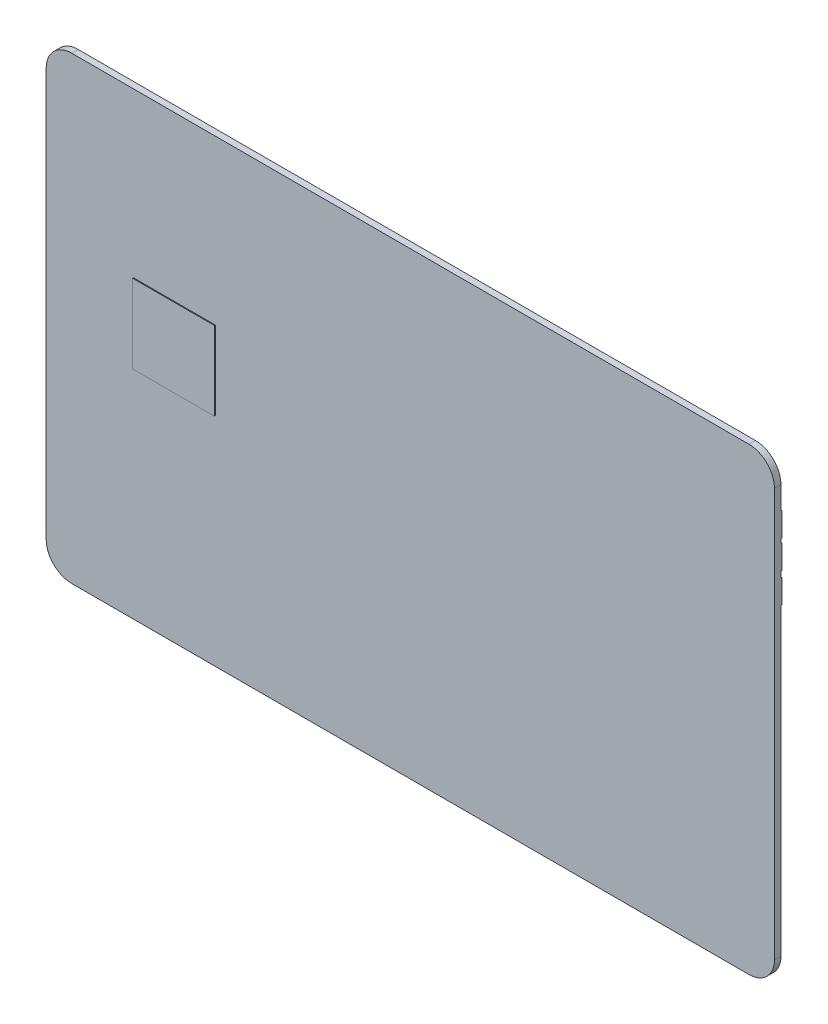
ISO-10303-21;
HEADER;
FILE_DESCRIPTION(('STEP AP214'),'2;1');
FILE_NAME('part.step','',(''),(''),'','','');
FILE_SCHEMA(('AUTOMOTIVE_DESIGN { 1 0 10303 214 1 1 1 1 }'));
ENDSEC;
DATA;
#1=APPLICATION_CONTEXT('core data for automotive mechanical design processes');
#2=APPLICATION_PROTOCOL_DEFINITION('international standard','automotive_design',2000,#1);
#3=PRODUCT_CONTEXT('',#1,'mechanical');
#4=PRODUCT('Part','Part','',(#3));
#5=PRODUCT_RELATED_PRODUCT_CATEGORY('part','',(#4));
#6=PRODUCT_DEFINITION_FORMATION('','',#4);
#7=PRODUCT_DEFINITION_CONTEXT('part definition',#1,'design');
#8=PRODUCT_DEFINITION('design','',#6,#7);
#9=PRODUCT_DEFINITION_SHAPE('','',#8);
#10=(LENGTH_UNIT() NAMED_UNIT(*) SI_UNIT(.MILLI.,.METRE.));
#11=(NAMED_UNIT(*) PLANE_ANGLE_UNIT() SI_UNIT($,.RADIAN.));
#12=(NAMED_UNIT(*) SI_UNIT($,.STERADIAN.) SOLID_ANGLE_UNIT());
#13=UNCERTAINTY_MEASURE_WITH_UNIT(LENGTH_MEASURE(1.E-05),#10,'distance_accuracy_value','');
#14=(GEOMETRIC_REPRESENTATION_CONTEXT(3) GLOBAL_UNCERTAINTY_ASSIGNED_CONTEXT((#13)) GLOBAL_UNIT_ASSIGNED_CONTEXT((#10,
#11,#12)) REPRESENTATION_CONTEXT('',''));
#15=CARTESIAN_POINT('',(0.,0.,0.));
#16=DIRECTION('',(0.,0.,1.));
#17=DIRECTION('',(1.,0.,0.));
#18=AXIS2_PLACEMENT_3D('',#15,#16,#17);
#19=CARTESIAN_POINT('',(0.,0.,-0.38));
#20=DIRECTION('',(0.,0.,-1.));
#21=DIRECTION('',(-1.,0.,0.));
#22=AXIS2_PLACEMENT_3D('',#19,#20,#21);
#23=PLANE('',#22);
#24=DIRECTION('',(1.,0.,0.));
#25=VECTOR('',#24,1.);
#26=CARTESIAN_POINT('',(42.8,18.5318,-0.38));
#27=LINE('',#26,#25);
#28=CARTESIAN_POINT('',(42.8,18.5318,-0.38));
#29=VERTEX_POINT('',#28);
#30=CARTESIAN_POINT('',(-42.8,18.5318,-0.38));
#31=VERTEX_POINT('',#30);
#32=EDGE_CURVE('E211',#29,#31,#27,.F.);
#33=ORIENTED_EDGE('',*,*,#32,.F.);
#34=DIRECTION('',(0.,1.,0.));
#35=VECTOR('',#34,1.);
#36=CARTESIAN_POINT('',(42.8,0.,-0.38));
#37=LINE('',#36,#35);
#38=CARTESIAN_POINT('',(42.8,18.0238,-0.38));
#39=VERTEX_POINT('',#38);
#40=EDGE_CURVE('E244',#29,#39,#37,.F.);
#41=ORIENTED_EDGE('',*,*,#40,.T.);
#42=DIRECTION('',(-1.,0.,0.));
#43=VECTOR('',#42,1.);
#44=CARTESIAN_POINT('',(-42.8,18.0238,-0.38));
#45=LINE('',#44,#43);
#46=CARTESIAN_POINT('',(-42.8,18.0238,-0.38));
#47=VERTEX_POINT('',#46);
#48=EDGE_CURVE('E193',#47,#39,#45,.F.);
#49=ORIENTED_EDGE('',*,*,#48,.F.);
#50=DIRECTION('',(0.,1.,0.));
#51=VECTOR('',#50,1.);
#52=CARTESIAN_POINT('',(-42.8,0.,-0.38));
#53=LINE('',#52,#51);
#54=EDGE_CURVE('E247',#47,#31,#53,.T.);
#55=ORIENTED_EDGE('',*,*,#54,.T.);
#56=EDGE_LOOP('',(#33,#41,#49,#55));
#57=FACE_BOUND('',#56,.T.);
#58=ADVANCED_FACE('F16',(#57),#23,.T.);
#59=CARTESIAN_POINT('',(0.,0.,-0.38));
#60=DIRECTION('',(0.,0.,-1.));
#61=DIRECTION('',(-1.,0.,0.));
#62=AXIS2_PLACEMENT_3D('',#59,#60,#61);
#63=PLANE('',#62);
#64=DIRECTION('',(-1.,0.,0.));
#65=VECTOR('',#64,1.);
#66=CARTESIAN_POINT('',(-42.8,14.4678,-0.38));
#67=LINE('',#66,#65);
#68=CARTESIAN_POINT('',(-42.8,14.4678,-0.38));
#69=VERTEX_POINT('',#68);
#70=CARTESIAN_POINT('',(42.8,14.4678,-0.38));
#71=VERTEX_POINT('',#70);
#72=EDGE_CURVE('E184',#69,#71,#67,.F.);
#73=ORIENTED_EDGE('',*,*,#72,.F.);
#74=DIRECTION('',(0.,1.,0.));
#75=VECTOR('',#74,1.);
#76=CARTESIAN_POINT('',(-42.8,0.,-0.38));
#77=LINE('',#76,#75);
#78=CARTESIAN_POINT('',(-42.8,15.2298,-0.38));
#79=VERTEX_POINT('',#78);
#80=EDGE_CURVE('E218',#69,#79,#77,.T.);
#81=ORIENTED_EDGE('',*,*,#80,.T.);
#82=DIRECTION('',(1.,0.,0.));
#83=VECTOR('',#82,1.);
#84=CARTESIAN_POINT('',(42.8,15.2298,-0.38));
#85=LINE('',#84,#83);
#86=CARTESIAN_POINT('',(42.8,15.2298,-0.38));
#87=VERTEX_POINT('',#86);
#88=EDGE_CURVE('E202',#87,#79,#85,.F.);
#89=ORIENTED_EDGE('',*,*,#88,.F.);
#90=DIRECTION('',(0.,1.,0.));
#91=VECTOR('',#90,1.);
#92=CARTESIAN_POINT('',(42.8,0.,-0.38));
#93=LINE('',#92,#91);
#94=EDGE_CURVE('E241',#87,#71,#93,.F.);
#95=ORIENTED_EDGE('',*,*,#94,.T.);
#96=EDGE_LOOP('',(#73,#81,#89,#95));
#97=FACE_BOUND('',#96,.T.);
#98=ADVANCED_FACE('F647',(#97),#63,.T.);
#99=CARTESIAN_POINT('',(-42.8,21.3258,-0.38));
#100=DIRECTION('',(0.,1.,0.));
#101=DIRECTION('',(-1.,0.,0.));
#102=AXIS2_PLACEMENT_3D('',#99,#100,#101);
#103=PLANE('',#102);
#104=DIRECTION('',(-1.,0.,0.));
#105=VECTOR('',#104,1.);
#106=CARTESIAN_POINT('',(0.,21.3258,-0.48));
#107=LINE('',#106,#105);
#108=CARTESIAN_POINT('',(-42.8,21.3258,-0.48));
#109=VERTEX_POINT('',#108);
#110=CARTESIAN_POINT('',(42.8,21.3258,-0.48));
#111=VERTEX_POINT('',#110);
#112=EDGE_CURVE('E139',#109,#111,#107,.F.);
#113=ORIENTED_EDGE('',*,*,#112,.F.);
#114=DIRECTION('',(0.,0.,1.));
#115=VECTOR('',#114,1.);
#116=CARTESIAN_POINT('',(-42.8,21.3258,-0.38));
#117=LINE('',#116,#115);
#118=CARTESIAN_POINT('',(-42.8,21.3258,-0.38));
#119=VERTEX_POINT('',#118);
#120=EDGE_CURVE('E214',#109,#119,#117,.T.);
#121=ORIENTED_EDGE('',*,*,#120,.T.);
#122=DIRECTION('',(-1.,0.,0.));
#123=VECTOR('',#122,1.);
#124=CARTESIAN_POINT('',(0.,21.3258,-0.38));
#125=LINE('',#124,#123);
#126=CARTESIAN_POINT('',(42.8,21.3258,-0.38));
#127=VERTEX_POINT('',#126);
#128=EDGE_CURVE('E147',#127,#119,#125,.T.);
#129=ORIENTED_EDGE('',*,*,#128,.F.);
#130=DIRECTION('',(0.,0.,1.));
#131=VECTOR('',#130,1.);
#132=CARTESIAN_POINT('',(42.8,21.3258,-0.38));
#133=LINE('',#132,#131);
#134=EDGE_CURVE('E215',#127,#111,#133,.F.);
#135=ORIENTED_EDGE('',*,*,#134,.T.);
#136=EDGE_LOOP('',(#113,#121,#129,#135));
#137=FACE_BOUND('',#136,.T.);
#138=ADVANCED_FACE('F383',(#137),#103,.T.);
#139=CARTESIAN_POINT('',(42.8,18.5318,-0.38));
#140=DIRECTION('',(0.,-1.,0.));
#141=DIRECTION('',(1.,0.,0.));
#142=AXIS2_PLACEMENT_3D('',#139,#140,#141);
#143=PLANE('',#142);
#144=DIRECTION('',(-1.,0.,0.));
#145=VECTOR('',#144,1.);
#146=CARTESIAN_POINT('',(0.,18.5318,-0.48));
#147=LINE('',#146,#145);
#148=CARTESIAN_POINT('',(42.8,18.5318,-0.48));
#149=VERTEX_POINT('',#148);
#150=CARTESIAN_POINT('',(-42.8,18.5318,-0.48));
#151=VERTEX_POINT('',#150);
#152=EDGE_CURVE('E136',#149,#151,#147,.T.);
#153=ORIENTED_EDGE('',*,*,#152,.F.);
#154=DIRECTION('',(0.,0.,1.));
#155=VECTOR('',#154,1.);
#156=CARTESIAN_POINT('',(42.8,18.5318,-0.38));
#157=LINE('',#156,#155);
#158=EDGE_CURVE('E205',#149,#29,#157,.T.);
#159=ORIENTED_EDGE('',*,*,#158,.T.);
#160=ORIENTED_EDGE('',*,*,#32,.T.);
#161=DIRECTION('',(0.,0.,1.));
#162=VECTOR('',#161,1.);
#163=CARTESIAN_POINT('',(-42.8,18.5318,-0.38));
#164=LINE('',#163,#162);
#165=EDGE_CURVE('E208',#31,#151,#164,.F.);
#166=ORIENTED_EDGE('',*,*,#165,.T.);
#167=EDGE_LOOP('',(#153,#159,#160,#166));
#168=FACE_BOUND('',#167,.T.);
#169=ADVANCED_FACE('F628',(#168),#143,.T.);
#170=CARTESIAN_POINT('',(42.8,15.2298,-0.38));
#171=DIRECTION('',(0.,-1.,0.));
#172=DIRECTION('',(1.,0.,0.));
#173=AXIS2_PLACEMENT_3D('',#170,#171,#172);
#174=PLANE('',#173);
#175=DIRECTION('',(-1.,0.,0.));
#176=VECTOR('',#175,1.);
#177=CARTESIAN_POINT('',(0.,15.2298,-0.48));
#178=LINE('',#177,#176);
#179=CARTESIAN_POINT('',(42.8,15.2298,-0.48));
#180=VERTEX_POINT('',#179);
#181=CARTESIAN_POINT('',(-42.8,15.2298,-0.48));
#182=VERTEX_POINT('',#181);
#183=EDGE_CURVE('E133',#180,#182,#178,.T.);
#184=ORIENTED_EDGE('',*,*,#183,.F.);
#185=DIRECTION('',(0.,0.,1.));
#186=VECTOR('',#185,1.);
#187=CARTESIAN_POINT('',(42.8,15.2298,-0.38));
#188=LINE('',#187,#186);
#189=EDGE_CURVE('E196',#180,#87,#188,.T.);
#190=ORIENTED_EDGE('',*,*,#189,.T.);
#191=ORIENTED_EDGE('',*,*,#88,.T.);
#192=DIRECTION('',(0.,0.,1.));
#193=VECTOR('',#192,1.);
#194=CARTESIAN_POINT('',(-42.8,15.2298,-0.38));
#195=LINE('',#194,#193);
#196=EDGE_CURVE('E199',#79,#182,#195,.F.);
#197=ORIENTED_EDGE('',*,*,#196,.T.);
#198=EDGE_LOOP('',(#184,#190,#191,#197));
#199=FACE_BOUND('',#198,.T.);
#200=ADVANCED_FACE('F618',(#199),#174,.T.);
#201=CARTESIAN_POINT('',(-42.8,18.0238,-0.38));
#202=DIRECTION('',(0.,1.,0.));
#203=DIRECTION('',(-1.,0.,0.));
#204=AXIS2_PLACEMENT_3D('',#201,#202,#203);
#205=PLANE('',#204);
#206=DIRECTION('',(-1.,0.,0.));
#207=VECTOR('',#206,1.);
#208=CARTESIAN_POINT('',(0.,18.0238,-0.48));
#209=LINE('',#208,#207);
#210=CARTESIAN_POINT('',(-42.8,18.0238,-0.48));
#211=VERTEX_POINT('',#210);
#212=CARTESIAN_POINT('',(42.8,18.0238,-0.48));
#213=VERTEX_POINT('',#212);
#214=EDGE_CURVE('E130',#211,#213,#209,.F.);
#215=ORIENTED_EDGE('',*,*,#214,.F.);
#216=DIRECTION('',(0.,0.,1.));
#217=VECTOR('',#216,1.);
#218=CARTESIAN_POINT('',(-42.8,18.0238,-0.38));
#219=LINE('',#218,#217);
#220=EDGE_CURVE('E187',#211,#47,#219,.T.);
#221=ORIENTED_EDGE('',*,*,#220,.T.);
#222=ORIENTED_EDGE('',*,*,#48,.T.);
#223=DIRECTION('',(0.,0.,1.));
#224=VECTOR('',#223,1.);
#225=CARTESIAN_POINT('',(42.8,18.0238,-0.38));
#226=LINE('',#225,#224);
#227=EDGE_CURVE('E190',#39,#213,#226,.F.);
#228=ORIENTED_EDGE('',*,*,#227,.T.);
#229=EDGE_LOOP('',(#215,#221,#222,#228));
#230=FACE_BOUND('',#229,.T.);
#231=ADVANCED_FACE('F608',(#230),#205,.T.);
#232=CARTESIAN_POINT('',(-42.8,14.4678,-0.38));
#233=DIRECTION('',(0.,1.,0.));
#234=DIRECTION('',(-1.,0.,0.));
#235=AXIS2_PLACEMENT_3D('',#232,#233,#234);
#236=PLANE('',#235);
#237=DIRECTION('',(-1.,0.,0.));
#238=VECTOR('',#237,1.);
#239=CARTESIAN_POINT('',(0.,14.4678,-0.48));
#240=LINE('',#239,#238);
#241=CARTESIAN_POINT('',(-42.8,14.4678,-0.48));
#242=VERTEX_POINT('',#241);
#243=CARTESIAN_POINT('',(42.8,14.4678,-0.48));
#244=VERTEX_POINT('',#243);
#245=EDGE_CURVE('E124',#242,#244,#240,.F.);
#246=ORIENTED_EDGE('',*,*,#245,.F.);
#247=DIRECTION('',(0.,0.,1.));
#248=VECTOR('',#247,1.);
#249=CARTESIAN_POINT('',(-42.8,14.4678,-0.38));
#250=LINE('',#249,#248);
#251=EDGE_CURVE('E172',#242,#69,#250,.T.);
#252=ORIENTED_EDGE('',*,*,#251,.T.);
#253=ORIENTED_EDGE('',*,*,#72,.T.);
#254=DIRECTION('',(0.,0.,1.));
#255=VECTOR('',#254,1.);
#256=CARTESIAN_POINT('',(42.8,14.4678,-0.38));
#257=LINE('',#256,#255);
#258=EDGE_CURVE('E181',#71,#244,#257,.F.);
#259=ORIENTED_EDGE('',*,*,#258,.T.);
#260=EDGE_LOOP('',(#246,#252,#253,#259));
#261=FACE_BOUND('',#260,.T.);
#262=ADVANCED_FACE('F598',(#261),#236,.T.);
#263=CARTESIAN_POINT('',(42.8,11.6738,-0.38));
#264=DIRECTION('',(0.,-1.,0.));
#265=DIRECTION('',(1.,0.,0.));
#266=AXIS2_PLACEMENT_3D('',#263,#264,#265);
#267=PLANE('',#266);
#268=DIRECTION('',(-1.,0.,0.));
#269=VECTOR('',#268,1.);
#270=CARTESIAN_POINT('',(0.,11.6738,-0.48));
#271=LINE('',#270,#269);
#272=CARTESIAN_POINT('',(42.8,11.6738,-0.48));
#273=VERTEX_POINT('',#272);
#274=CARTESIAN_POINT('',(-42.8,11.6738,-0.48));
#275=VERTEX_POINT('',#274);
#276=EDGE_CURVE('E129',#273,#275,#271,.T.);
#277=ORIENTED_EDGE('',*,*,#276,.F.);
#278=DIRECTION('',(0.,0.,1.));
#279=VECTOR('',#278,1.);
#280=CARTESIAN_POINT('',(42.8,11.6738,-0.38));
#281=LINE('',#280,#279);
#282=CARTESIAN_POINT('',(42.8,11.6738,-0.38));
#283=VERTEX_POINT('',#282);
#284=EDGE_CURVE('E150',#273,#283,#281,.T.);
#285=ORIENTED_EDGE('',*,*,#284,.T.);
#286=DIRECTION('',(-1.,0.,0.));
#287=VECTOR('',#286,1.);
#288=CARTESIAN_POINT('',(0.,11.6738,-0.38));
#289=LINE('',#288,#287);
#290=CARTESIAN_POINT('',(-42.8,11.6738,-0.38));
#291=VERTEX_POINT('',#290);
#292=EDGE_CURVE('E122',#291,#283,#289,.F.);
#293=ORIENTED_EDGE('',*,*,#292,.F.);
#294=DIRECTION('',(0.,0.,1.));
#295=VECTOR('',#294,1.);
#296=CARTESIAN_POINT('',(-42.8,11.6738,-0.38));
#297=LINE('',#296,#295);
#298=EDGE_CURVE('E169',#291,#275,#297,.F.);
#299=ORIENTED_EDGE('',*,*,#298,.T.);
#300=EDGE_LOOP('',(#277,#285,#293,#299));
#301=FACE_BOUND('',#300,.T.);
#302=ADVANCED_FACE('F590',(#301),#267,.T.);
#303=CARTESIAN_POINT('',(-27.74,3.14499999999999,0.48));
#304=DIRECTION('',(0.,0.,1.));
#305=DIRECTION('',(1.,0.,0.));
#306=AXIS2_PLACEMENT_3D('',#303,#304,#305);
#307=PLANE('',#306);
#308=DIRECTION('',(-1.,0.,0.));
#309=VECTOR('',#308,1.);
#310=CARTESIAN_POINT('',(-22.93,7.75999999999999,0.48));
#311=LINE('',#310,#309);
#312=CARTESIAN_POINT('',(-32.55,7.75999999999999,0.48));
#313=VERTEX_POINT('',#312);
#314=CARTESIAN_POINT('',(-22.93,7.75999999999999,0.48));
#315=VERTEX_POINT('',#314);
#316=EDGE_CURVE('E304',#313,#315,#311,.F.);
#317=ORIENTED_EDGE('',*,*,#316,.F.);
#318=DIRECTION('',(0.,1.,0.));
#319=VECTOR('',#318,1.);
#320=CARTESIAN_POINT('',(-32.55,7.75999999999999,0.48));
#321=LINE('',#320,#319);
#322=CARTESIAN_POINT('',(-32.55,-1.47000000000001,0.48));
#323=VERTEX_POINT('',#322);
#324=EDGE_CURVE('E113',#323,#313,#321,.T.);
#325=ORIENTED_EDGE('',*,*,#324,.F.);
#326=DIRECTION('',(1.,0.,0.));
#327=VECTOR('',#326,1.);
#328=CARTESIAN_POINT('',(-32.55,-1.47000000000001,0.48));
#329=LINE('',#328,#327);
#330=CARTESIAN_POINT('',(-22.93,-1.47000000000001,0.48));
#331=VERTEX_POINT('',#330);
#332=EDGE_CURVE('E292',#331,#323,#329,.F.);
#333=ORIENTED_EDGE('',*,*,#332,.F.);
#334=DIRECTION('',(0.,1.,0.));
#335=VECTOR('',#334,1.);
#336=CARTESIAN_POINT('',(-22.93,-1.47000000000001,0.48));
#337=LINE('',#336,#335);
#338=EDGE_CURVE('E298',#315,#331,#337,.F.);
#339=ORIENTED_EDGE('',*,*,#338,.F.);
#340=EDGE_LOOP('',(#317,#325,#333,#339));
#341=FACE_BOUND('',#340,.T.);
#342=ADVANCED_FACE('F327',(#341),#307,.T.);
#343=CARTESIAN_POINT('',(0.,0.,-0.38));
#344=DIRECTION('',(0.,0.,-1.));
#345=DIRECTION('',(-1.,0.,0.));
#346=AXIS2_PLACEMENT_3D('',#343,#344,#345);
#347=PLANE('',#346);
#348=CARTESIAN_POINT('',(39.8,23.99,-0.38));
#349=DIRECTION('',(0.,0.,-1.));
#350=DIRECTION('',(-1.,0.,0.));
#351=AXIS2_PLACEMENT_3D('',#348,#349,#350);
#352=CIRCLE('',#351,3.);
#353=CARTESIAN_POINT('',(42.8,23.99,-0.38));
#354=VERTEX_POINT('',#353);
#355=CARTESIAN_POINT('',(39.8,26.99,-0.38));
#356=VERTEX_POINT('',#355);
#357=EDGE_CURVE('E161',#354,#356,#352,.F.);
#358=ORIENTED_EDGE('',*,*,#357,.F.);
#359=DIRECTION('',(0.,1.,0.));
#360=VECTOR('',#359,1.);
#361=CARTESIAN_POINT('',(42.8,-26.99,-0.38));
#362=LINE('',#361,#360);
#363=EDGE_CURVE('E158',#127,#354,#362,.T.);
#364=ORIENTED_EDGE('',*,*,#363,.F.);
#365=ORIENTED_EDGE('',*,*,#128,.T.);
#366=DIRECTION('',(0.,1.,0.));
#367=VECTOR('',#366,1.);
#368=CARTESIAN_POINT('',(-42.8,26.99,-0.38));
#369=LINE('',#368,#367);
#370=CARTESIAN_POINT('',(-42.8,23.99,-0.38));
#371=VERTEX_POINT('',#370);
#372=EDGE_CURVE('E140',#371,#119,#369,.F.);
#373=ORIENTED_EDGE('',*,*,#372,.F.);
#374=CARTESIAN_POINT('',(-39.8,23.99,-0.38));
#375=DIRECTION('',(0.,0.,-1.));
#376=DIRECTION('',(-1.,0.,0.));
#377=AXIS2_PLACEMENT_3D('',#374,#375,#376);
#378=CIRCLE('',#377,3.);
#379=CARTESIAN_POINT('',(-39.8,26.99,-0.38));
#380=VERTEX_POINT('',#379);
#381=EDGE_CURVE('E156',#380,#371,#378,.F.);
#382=ORIENTED_EDGE('',*,*,#381,.F.);
#383=DIRECTION('',(-1.,0.,0.));
#384=VECTOR('',#383,1.);
#385=CARTESIAN_POINT('',(42.8,26.99,-0.38));
#386=LINE('',#385,#384);
#387=EDGE_CURVE('E153',#356,#380,#386,.T.);
#388=ORIENTED_EDGE('',*,*,#387,.F.);
#389=EDGE_LOOP('',(#358,#364,#365,#373,#382,#388));
#390=FACE_BOUND('',#389,.T.);
#391=ADVANCED_FACE('F386',(#390),#347,.T.);
#392=CARTESIAN_POINT('',(0.,19.9288,-0.48));
#393=DIRECTION('',(0.,0.,-1.));
#394=DIRECTION('',(-1.,0.,0.));
#395=AXIS2_PLACEMENT_3D('',#392,#393,#394);
#396=PLANE('',#395);
#397=DIRECTION('',(0.,1.,0.));
#398=VECTOR('',#397,1.);
#399=CARTESIAN_POINT('',(42.8,-26.99,-0.48));
#400=LINE('',#399,#398);
#401=EDGE_CURVE('E162',#149,#111,#400,.T.);
#402=ORIENTED_EDGE('',*,*,#401,.F.);
#403=ORIENTED_EDGE('',*,*,#152,.T.);
#404=DIRECTION('',(0.,1.,0.));
#405=VECTOR('',#404,1.);
#406=CARTESIAN_POINT('',(-42.8,26.99,-0.48));
#407=LINE('',#406,#405);
#408=EDGE_CURVE('E143',#109,#151,#407,.F.);
#409=ORIENTED_EDGE('',*,*,#408,.F.);
#410=ORIENTED_EDGE('',*,*,#112,.T.);
#411=EDGE_LOOP('',(#402,#403,#409,#410));
#412=FACE_BOUND('',#411,.T.);
#413=ADVANCED_FACE('F562',(#412),#396,.T.);
#414=CARTESIAN_POINT('',(0.,16.6268,-0.48));
#415=DIRECTION('',(0.,0.,-1.));
#416=DIRECTION('',(-1.,0.,0.));
#417=AXIS2_PLACEMENT_3D('',#414,#415,#416);
#418=PLANE('',#417);
#419=DIRECTION('',(0.,1.,0.));
#420=VECTOR('',#419,1.);
#421=CARTESIAN_POINT('',(-42.8,26.99,-0.48));
#422=LINE('',#421,#420);
#423=EDGE_CURVE('E236',#211,#182,#422,.F.);
#424=ORIENTED_EDGE('',*,*,#423,.F.);
#425=ORIENTED_EDGE('',*,*,#214,.T.);
#426=DIRECTION('',(0.,1.,0.));
#427=VECTOR('',#426,1.);
#428=CARTESIAN_POINT('',(42.8,-26.99,-0.48));
#429=LINE('',#428,#427);
#430=EDGE_CURVE('E231',#180,#213,#429,.T.);
#431=ORIENTED_EDGE('',*,*,#430,.F.);
#432=ORIENTED_EDGE('',*,*,#183,.T.);
#433=EDGE_LOOP('',(#424,#425,#431,#432));
#434=FACE_BOUND('',#433,.T.);
#435=ADVANCED_FACE('F552',(#434),#418,.T.);
#436=CARTESIAN_POINT('',(0.,13.0708,-0.48));
#437=DIRECTION('',(0.,0.,-1.));
#438=DIRECTION('',(-1.,0.,0.));
#439=AXIS2_PLACEMENT_3D('',#436,#437,#438);
#440=PLANE('',#439);
#441=DIRECTION('',(0.,1.,0.));
#442=VECTOR('',#441,1.);
#443=CARTESIAN_POINT('',(-42.8,26.99,-0.48));
#444=LINE('',#443,#442);
#445=EDGE_CURVE('E119',#242,#275,#444,.F.);
#446=ORIENTED_EDGE('',*,*,#445,.F.);
#447=ORIENTED_EDGE('',*,*,#245,.T.);
#448=DIRECTION('',(0.,1.,0.));
#449=VECTOR('',#448,1.);
#450=CARTESIAN_POINT('',(42.8,-26.99,-0.48));
#451=LINE('',#450,#449);
#452=EDGE_CURVE('E166',#273,#244,#451,.T.);
#453=ORIENTED_EDGE('',*,*,#452,.F.);
#454=ORIENTED_EDGE('',*,*,#276,.T.);
#455=EDGE_LOOP('',(#446,#447,#453,#454));
#456=FACE_BOUND('',#455,.T.);
#457=ADVANCED_FACE('F542',(#456),#440,.T.);
#458=CARTESIAN_POINT('',(0.,0.,-0.38));
#459=DIRECTION('',(0.,0.,-1.));
#460=DIRECTION('',(-1.,0.,0.));
#461=AXIS2_PLACEMENT_3D('',#458,#459,#460);
#462=PLANE('',#461);
#463=CARTESIAN_POINT('',(-39.8,-23.99,-0.38));
#464=DIRECTION('',(0.,0.,-1.));
#465=DIRECTION('',(-1.,0.,0.));
#466=AXIS2_PLACEMENT_3D('',#463,#464,#465);
#467=CIRCLE('',#466,3.);
#468=CARTESIAN_POINT('',(-42.8,-23.99,-0.38));
#469=VERTEX_POINT('',#468);
#470=CARTESIAN_POINT('',(-39.8,-26.99,-0.38));
#471=VERTEX_POINT('',#470);
#472=EDGE_CURVE('E118',#469,#471,#467,.F.);
#473=ORIENTED_EDGE('',*,*,#472,.F.);
#474=DIRECTION('',(0.,1.,0.));
#475=VECTOR('',#474,1.);
#476=CARTESIAN_POINT('',(-42.8,26.99,-0.38));
#477=LINE('',#476,#475);
#478=EDGE_CURVE('E115',#291,#469,#477,.F.);
#479=ORIENTED_EDGE('',*,*,#478,.F.);
#480=ORIENTED_EDGE('',*,*,#292,.T.);
#481=DIRECTION('',(0.,1.,0.));
#482=VECTOR('',#481,1.);
#483=CARTESIAN_POINT('',(42.8,-26.99,-0.38));
#484=LINE('',#483,#482);
#485=CARTESIAN_POINT('',(42.8,-23.99,-0.38));
#486=VERTEX_POINT('',#485);
#487=EDGE_CURVE('E91',#486,#283,#484,.T.);
#488=ORIENTED_EDGE('',*,*,#487,.F.);
#489=CARTESIAN_POINT('',(39.8,-23.99,-0.38));
#490=DIRECTION('',(0.,0.,1.));
#491=DIRECTION('',(1.,0.,0.));
#492=AXIS2_PLACEMENT_3D('',#489,#490,#491);
#493=CIRCLE('',#492,3.);
#494=CARTESIAN_POINT('',(39.8,-26.99,-0.38));
#495=VERTEX_POINT('',#494);
#496=EDGE_CURVE('E19',#495,#486,#493,.T.);
#497=ORIENTED_EDGE('',*,*,#496,.F.);
#498=DIRECTION('',(1.,0.,0.));
#499=VECTOR('',#498,1.);
#500=CARTESIAN_POINT('',(-42.8,-26.99,-0.38));
#501=LINE('',#500,#499);
#502=EDGE_CURVE('E88',#471,#495,#501,.T.);
#503=ORIENTED_EDGE('',*,*,#502,.F.);
#504=EDGE_LOOP('',(#473,#479,#480,#488,#497,#503));
#505=FACE_BOUND('',#504,.T.);
#506=ADVANCED_FACE('F86',(#505),#462,.T.);
#507=CARTESIAN_POINT('',(-32.55,7.75999999999999,0.38));
#508=DIRECTION('',(-1.,0.,0.));
#509=DIRECTION('',(0.,0.,1.));
#510=AXIS2_PLACEMENT_3D('',#507,#508,#509);
#511=PLANE('',#510);
#512=ORIENTED_EDGE('',*,*,#324,.T.);
#513=DIRECTION('',(0.,0.,1.));
#514=VECTOR('',#513,1.);
#515=CARTESIAN_POINT('',(-32.55,7.75999999999999,0.38));
#516=LINE('',#515,#514);
#517=CARTESIAN_POINT('',(-32.55,7.75999999999999,0.38));
#518=VERTEX_POINT('',#517);
#519=EDGE_CURVE('E306',#518,#313,#516,.T.);
#520=ORIENTED_EDGE('',*,*,#519,.F.);
#521=DIRECTION('',(0.,1.,0.));
#522=VECTOR('',#521,1.);
#523=CARTESIAN_POINT('',(-32.55,0.,0.38));
#524=LINE('',#523,#522);
#525=CARTESIAN_POINT('',(-32.55,-1.47000000000001,0.38));
#526=VERTEX_POINT('',#525);
#527=EDGE_CURVE('E105',#526,#518,#524,.T.);
#528=ORIENTED_EDGE('',*,*,#527,.F.);
#529=DIRECTION('',(0.,0.,1.));
#530=VECTOR('',#529,1.);
#531=CARTESIAN_POINT('',(-32.55,-1.47000000000001,0.38));
#532=LINE('',#531,#530);
#533=EDGE_CURVE('E95',#323,#526,#532,.F.);
#534=ORIENTED_EDGE('',*,*,#533,.F.);
#535=EDGE_LOOP('',(#512,#520,#528,#534));
#536=FACE_BOUND('',#535,.T.);
#537=ADVANCED_FACE('F317',(#536),#511,.T.);
#538=CARTESIAN_POINT('',(-22.93,7.75999999999999,0.38));
#539=DIRECTION('',(0.,1.,0.));
#540=DIRECTION('',(-1.,0.,0.));
#541=AXIS2_PLACEMENT_3D('',#538,#539,#540);
#542=PLANE('',#541);
#543=ORIENTED_EDGE('',*,*,#316,.T.);
#544=DIRECTION('',(0.,0.,-1.));
#545=VECTOR('',#544,1.);
#546=CARTESIAN_POINT('',(-22.93,7.75999999999999,0.38));
#547=LINE('',#546,#545);
#548=CARTESIAN_POINT('',(-22.93,7.75999999999999,0.38));
#549=VERTEX_POINT('',#548);
#550=EDGE_CURVE('E301',#549,#315,#547,.F.);
#551=ORIENTED_EDGE('',*,*,#550,.F.);
#552=DIRECTION('',(1.,0.,0.));
#553=VECTOR('',#552,1.);
#554=CARTESIAN_POINT('',(0.,7.75999999999999,0.38));
#555=LINE('',#554,#553);
#556=EDGE_CURVE('E108',#518,#549,#555,.T.);
#557=ORIENTED_EDGE('',*,*,#556,.F.);
#558=ORIENTED_EDGE('',*,*,#519,.T.);
#559=EDGE_LOOP('',(#543,#551,#557,#558));
#560=FACE_BOUND('',#559,.T.);
#561=ADVANCED_FACE('F329',(#560),#542,.T.);
#562=CARTESIAN_POINT('',(-22.93,-1.47000000000001,0.38));
#563=DIRECTION('',(1.,0.,0.));
#564=DIRECTION('',(0.,0.,-1.));
#565=AXIS2_PLACEMENT_3D('',#562,#563,#564);
#566=PLANE('',#565);
#567=ORIENTED_EDGE('',*,*,#338,.T.);
#568=DIRECTION('',(0.,0.,1.));
#569=VECTOR('',#568,1.);
#570=CARTESIAN_POINT('',(-22.93,-1.47000000000001,0.38));
#571=LINE('',#570,#569);
#572=CARTESIAN_POINT('',(-22.93,-1.47000000000001,0.38));
#573=VERTEX_POINT('',#572);
#574=EDGE_CURVE('E295',#573,#331,#571,.T.);
#575=ORIENTED_EDGE('',*,*,#574,.F.);
#576=DIRECTION('',(0.,1.,0.));
#577=VECTOR('',#576,1.);
#578=CARTESIAN_POINT('',(-22.93,0.,0.38));
#579=LINE('',#578,#577);
#580=EDGE_CURVE('E404',#549,#573,#579,.F.);
#581=ORIENTED_EDGE('',*,*,#580,.F.);
#582=ORIENTED_EDGE('',*,*,#550,.T.);
#583=EDGE_LOOP('',(#567,#575,#581,#582));
#584=FACE_BOUND('',#583,.T.);
#585=ADVANCED_FACE('F506',(#584),#566,.T.);
#586=CARTESIAN_POINT('',(-32.55,-1.47000000000001,0.38));
#587=DIRECTION('',(0.,-1.,0.));
#588=DIRECTION('',(1.,0.,0.));
#589=AXIS2_PLACEMENT_3D('',#586,#587,#588);
#590=PLANE('',#589);
#591=ORIENTED_EDGE('',*,*,#332,.T.);
#592=ORIENTED_EDGE('',*,*,#533,.T.);
#593=DIRECTION('',(1.,0.,0.));
#594=VECTOR('',#593,1.);
#595=CARTESIAN_POINT('',(0.,-1.47000000000001,0.38));
#596=LINE('',#595,#594);
#597=EDGE_CURVE('E274',#573,#526,#596,.F.);
#598=ORIENTED_EDGE('',*,*,#597,.F.);
#599=ORIENTED_EDGE('',*,*,#574,.T.);
#600=EDGE_LOOP('',(#591,#592,#598,#599));
#601=FACE_BOUND('',#600,.T.);
#602=ADVANCED_FACE('F496',(#601),#590,.T.);
#603=CARTESIAN_POINT('',(39.8,-23.99,0.));
#604=DIRECTION('',(0.,0.,1.));
#605=DIRECTION('',(1.,0.,0.));
#606=AXIS2_PLACEMENT_3D('',#603,#604,#605);
#607=CYLINDRICAL_SURFACE('',#606,3.);
#608=ORIENTED_EDGE('',*,*,#496,.T.);
#609=DIRECTION('',(0.,0.,1.));
#610=VECTOR('',#609,1.);
#611=CARTESIAN_POINT('',(42.8,-23.99,0.));
#612=LINE('',#611,#610);
#613=CARTESIAN_POINT('',(42.8,-23.99,0.38));
#614=VERTEX_POINT('',#613);
#615=EDGE_CURVE('E94',#614,#486,#612,.F.);
#616=ORIENTED_EDGE('',*,*,#615,.F.);
#617=CARTESIAN_POINT('',(39.8,-23.99,0.38));
#618=DIRECTION('',(0.,0.,1.));
#619=DIRECTION('',(1.,0.,0.));
#620=AXIS2_PLACEMENT_3D('',#617,#618,#619);
#621=CIRCLE('',#620,3.);
#622=CARTESIAN_POINT('',(39.8,-26.99,0.38));
#623=VERTEX_POINT('',#622);
#624=EDGE_CURVE('E100',#623,#614,#621,.T.);
#625=ORIENTED_EDGE('',*,*,#624,.F.);
#626=DIRECTION('',(0.,0.,-1.));
#627=VECTOR('',#626,1.);
#628=CARTESIAN_POINT('',(39.8,-26.99,0.));
#629=LINE('',#628,#627);
#630=EDGE_CURVE('E97',#495,#623,#629,.F.);
#631=ORIENTED_EDGE('',*,*,#630,.F.);
#632=EDGE_LOOP('',(#608,#616,#625,#631));
#633=FACE_BOUND('',#632,.T.);
#634=ADVANCED_FACE('F98',(#633),#607,.T.);
#635=CARTESIAN_POINT('',(42.8,-26.99,0.));
#636=DIRECTION('',(1.,0.,0.));
#637=DIRECTION('',(0.,1.,0.));
#638=AXIS2_PLACEMENT_3D('',#635,#636,#637);
#639=PLANE('',#638);
#640=DIRECTION('',(0.,0.,-1.));
#641=VECTOR('',#640,1.);
#642=CARTESIAN_POINT('',(42.8,23.99,0.));
#643=LINE('',#642,#641);
#644=CARTESIAN_POINT('',(42.8,23.99,0.38));
#645=VERTEX_POINT('',#644);
#646=EDGE_CURVE('E277',#645,#354,#643,.T.);
#647=ORIENTED_EDGE('',*,*,#646,.F.);
#648=DIRECTION('',(0.,1.,0.));
#649=VECTOR('',#648,1.);
#650=CARTESIAN_POINT('',(42.8,0.,0.38));
#651=LINE('',#650,#649);
#652=EDGE_CURVE('E272',#614,#645,#651,.T.);
#653=ORIENTED_EDGE('',*,*,#652,.F.);
#654=ORIENTED_EDGE('',*,*,#615,.T.);
#655=ORIENTED_EDGE('',*,*,#487,.T.);
#656=ORIENTED_EDGE('',*,*,#284,.F.);
#657=ORIENTED_EDGE('',*,*,#452,.T.);
#658=ORIENTED_EDGE('',*,*,#258,.F.);
#659=ORIENTED_EDGE('',*,*,#94,.F.);
#660=ORIENTED_EDGE('',*,*,#189,.F.);
#661=ORIENTED_EDGE('',*,*,#430,.T.);
#662=ORIENTED_EDGE('',*,*,#227,.F.);
#663=ORIENTED_EDGE('',*,*,#40,.F.);
#664=ORIENTED_EDGE('',*,*,#158,.F.);
#665=ORIENTED_EDGE('',*,*,#401,.T.);
#666=ORIENTED_EDGE('',*,*,#134,.F.);
#667=ORIENTED_EDGE('',*,*,#363,.T.);
#668=EDGE_LOOP('',(#647,#653,#654,#655,#656,#657,#658,#659,#660,#661,#662,#663,#664,#665,#666,#667));
#669=FACE_BOUND('',#668,.T.);
#670=ADVANCED_FACE('F377',(#669),#639,.T.);
#671=CARTESIAN_POINT('',(39.8,23.99,0.));
#672=DIRECTION('',(0.,0.,-1.));
#673=DIRECTION('',(-1.,0.,0.));
#674=AXIS2_PLACEMENT_3D('',#671,#672,#673);
#675=CYLINDRICAL_SURFACE('',#674,3.);
#676=CARTESIAN_POINT('',(39.8,23.99,0.38));
#677=DIRECTION('',(0.,0.,-1.));
#678=DIRECTION('',(-1.,0.,0.));
#679=AXIS2_PLACEMENT_3D('',#676,#677,#678);
#680=CIRCLE('',#679,3.);
#681=CARTESIAN_POINT('',(39.8,26.99,0.38));
#682=VERTEX_POINT('',#681);
#683=EDGE_CURVE('E269',#645,#682,#680,.F.);
#684=ORIENTED_EDGE('',*,*,#683,.F.);
#685=ORIENTED_EDGE('',*,*,#646,.T.);
#686=ORIENTED_EDGE('',*,*,#357,.T.);
#687=DIRECTION('',(0.,0.,1.));
#688=VECTOR('',#687,1.);
#689=CARTESIAN_POINT('',(39.8,26.99,0.));
#690=LINE('',#689,#688);
#691=EDGE_CURVE('E157',#682,#356,#690,.F.);
#692=ORIENTED_EDGE('',*,*,#691,.F.);
#693=EDGE_LOOP('',(#684,#685,#686,#692));
#694=FACE_BOUND('',#693,.T.);
#695=ADVANCED_FACE('F392',(#694),#675,.T.);
#696=CARTESIAN_POINT('',(42.8,26.99,0.));
#697=DIRECTION('',(0.,1.,0.));
#698=DIRECTION('',(-1.,0.,0.));
#699=AXIS2_PLACEMENT_3D('',#696,#697,#698);
#700=PLANE('',#699);
#701=ORIENTED_EDGE('',*,*,#691,.T.);
#702=ORIENTED_EDGE('',*,*,#387,.T.);
#703=DIRECTION('',(0.,0.,-1.));
#704=VECTOR('',#703,1.);
#705=CARTESIAN_POINT('',(-39.8,26.99,0.));
#706=LINE('',#705,#704);
#707=CARTESIAN_POINT('',(-39.8,26.99,0.38));
#708=VERTEX_POINT('',#707);
#709=EDGE_CURVE('E276',#708,#380,#706,.T.);
#710=ORIENTED_EDGE('',*,*,#709,.F.);
#711=DIRECTION('',(1.,0.,0.));
#712=VECTOR('',#711,1.);
#713=CARTESIAN_POINT('',(0.,26.99,0.38));
#714=LINE('',#713,#712);
#715=EDGE_CURVE('E268',#682,#708,#714,.F.);
#716=ORIENTED_EDGE('',*,*,#715,.F.);
#717=EDGE_LOOP('',(#701,#702,#710,#716));
#718=FACE_BOUND('',#717,.T.);
#719=ADVANCED_FACE('F390',(#718),#700,.T.);
#720=CARTESIAN_POINT('',(-39.8,23.99,0.));
#721=DIRECTION('',(0.,0.,-1.));
#722=DIRECTION('',(-1.,0.,0.));
#723=AXIS2_PLACEMENT_3D('',#720,#721,#722);
#724=CYLINDRICAL_SURFACE('',#723,3.);
#725=CARTESIAN_POINT('',(-39.8,23.99,0.38));
#726=DIRECTION('',(0.,0.,-1.));
#727=DIRECTION('',(-1.,0.,0.));
#728=AXIS2_PLACEMENT_3D('',#725,#726,#727);
#729=CIRCLE('',#728,3.);
#730=CARTESIAN_POINT('',(-42.8,23.99,0.38));
#731=VERTEX_POINT('',#730);
#732=EDGE_CURVE('E265',#708,#731,#729,.F.);
#733=ORIENTED_EDGE('',*,*,#732,.F.);
#734=ORIENTED_EDGE('',*,*,#709,.T.);
#735=ORIENTED_EDGE('',*,*,#381,.T.);
#736=DIRECTION('',(0.,0.,1.));
#737=VECTOR('',#736,1.);
#738=CARTESIAN_POINT('',(-42.8,23.99,0.));
#739=LINE('',#738,#737);
#740=EDGE_CURVE('E144',#731,#371,#739,.F.);
#741=ORIENTED_EDGE('',*,*,#740,.F.);
#742=EDGE_LOOP('',(#733,#734,#735,#741));
#743=FACE_BOUND('',#742,.T.);
#744=ADVANCED_FACE('F416',(#743),#724,.T.);
#745=CARTESIAN_POINT('',(-42.8,26.99,0.));
#746=DIRECTION('',(-1.,0.,0.));
#747=DIRECTION('',(0.,0.,1.));
#748=AXIS2_PLACEMENT_3D('',#745,#746,#747);
#749=PLANE('',#748);
#750=ORIENTED_EDGE('',*,*,#298,.F.);
#751=ORIENTED_EDGE('',*,*,#478,.T.);
#752=DIRECTION('',(0.,0.,-1.));
#753=VECTOR('',#752,1.);
#754=CARTESIAN_POINT('',(-42.8,-23.99,0.));
#755=LINE('',#754,#753);
#756=CARTESIAN_POINT('',(-42.8,-23.99,0.38));
#757=VERTEX_POINT('',#756);
#758=EDGE_CURVE('E102',#757,#469,#755,.T.);
#759=ORIENTED_EDGE('',*,*,#758,.F.);
#760=DIRECTION('',(0.,1.,0.));
#761=VECTOR('',#760,1.);
#762=CARTESIAN_POINT('',(-42.8,0.,0.38));
#763=LINE('',#762,#761);
#764=EDGE_CURVE('E264',#731,#757,#763,.F.);
#765=ORIENTED_EDGE('',*,*,#764,.F.);
#766=ORIENTED_EDGE('',*,*,#740,.T.);
#767=ORIENTED_EDGE('',*,*,#372,.T.);
#768=ORIENTED_EDGE('',*,*,#120,.F.);
#769=ORIENTED_EDGE('',*,*,#408,.T.);
#770=ORIENTED_EDGE('',*,*,#165,.F.);
#771=ORIENTED_EDGE('',*,*,#54,.F.);
#772=ORIENTED_EDGE('',*,*,#220,.F.);
#773=ORIENTED_EDGE('',*,*,#423,.T.);
#774=ORIENTED_EDGE('',*,*,#196,.F.);
#775=ORIENTED_EDGE('',*,*,#80,.F.);
#776=ORIENTED_EDGE('',*,*,#251,.F.);
#777=ORIENTED_EDGE('',*,*,#445,.T.);
#778=EDGE_LOOP('',(#750,#751,#759,#765,#766,#767,#768,#769,#770,#771,#772,#773,#774,#775,#776,#777));
#779=FACE_BOUND('',#778,.T.);
#780=ADVANCED_FACE('F420',(#779),#749,.T.);
#781=CARTESIAN_POINT('',(-39.8,-23.99,0.));
#782=DIRECTION('',(0.,0.,-1.));
#783=DIRECTION('',(-1.,0.,0.));
#784=AXIS2_PLACEMENT_3D('',#781,#782,#783);
#785=CYLINDRICAL_SURFACE('',#784,3.);
#786=CARTESIAN_POINT('',(-39.8,-23.99,0.38));
#787=DIRECTION('',(0.,0.,-1.));
#788=DIRECTION('',(-1.,0.,0.));
#789=AXIS2_PLACEMENT_3D('',#786,#787,#788);
#790=CIRCLE('',#789,3.);
#791=CARTESIAN_POINT('',(-39.8,-26.99,0.38));
#792=VERTEX_POINT('',#791);
#793=EDGE_CURVE('E25',#757,#792,#790,.F.);
#794=ORIENTED_EDGE('',*,*,#793,.F.);
#795=ORIENTED_EDGE('',*,*,#758,.T.);
#796=ORIENTED_EDGE('',*,*,#472,.T.);
#797=DIRECTION('',(0.,0.,-1.));
#798=VECTOR('',#797,1.);
#799=CARTESIAN_POINT('',(-39.8,-26.99,0.));
#800=LINE('',#799,#798);
#801=EDGE_CURVE('E34',#792,#471,#800,.T.);
#802=ORIENTED_EDGE('',*,*,#801,.F.);
#803=EDGE_LOOP('',(#794,#795,#796,#802));
#804=FACE_BOUND('',#803,.T.);
#805=ADVANCED_FACE('F422',(#804),#785,.T.);
#806=CARTESIAN_POINT('',(-42.8,-26.99,0.));
#807=DIRECTION('',(0.,-1.,0.));
#808=DIRECTION('',(0.,0.,-1.));
#809=AXIS2_PLACEMENT_3D('',#806,#807,#808);
#810=PLANE('',#809);
#811=ORIENTED_EDGE('',*,*,#801,.T.);
#812=ORIENTED_EDGE('',*,*,#502,.T.);
#813=ORIENTED_EDGE('',*,*,#630,.T.);
#814=DIRECTION('',(1.,0.,0.));
#815=VECTOR('',#814,1.);
#816=CARTESIAN_POINT('',(0.,-26.99,0.38));
#817=LINE('',#816,#815);
#818=EDGE_CURVE('E10',#792,#623,#817,.T.);
#819=ORIENTED_EDGE('',*,*,#818,.F.);
#820=EDGE_LOOP('',(#811,#812,#813,#819));
#821=FACE_BOUND('',#820,.T.);
#822=ADVANCED_FACE('F104',(#821),#810,.T.);
#823=CARTESIAN_POINT('',(0.,0.,0.38));
#824=DIRECTION('',(0.,0.,1.));
#825=DIRECTION('',(1.,0.,0.));
#826=AXIS2_PLACEMENT_3D('',#823,#824,#825);
#827=PLANE('',#826);
#828=ORIENTED_EDGE('',*,*,#793,.T.);
#829=ORIENTED_EDGE('',*,*,#818,.T.);
#830=ORIENTED_EDGE('',*,*,#624,.T.);
#831=ORIENTED_EDGE('',*,*,#652,.T.);
#832=ORIENTED_EDGE('',*,*,#683,.T.);
#833=ORIENTED_EDGE('',*,*,#715,.T.);
#834=ORIENTED_EDGE('',*,*,#732,.T.);
#835=ORIENTED_EDGE('',*,*,#764,.T.);
#836=EDGE_LOOP('',(#828,#829,#830,#831,#832,#833,#834,#835));
#837=FACE_BOUND('',#836,.T.);
#838=ORIENTED_EDGE('',*,*,#580,.T.);
#839=ORIENTED_EDGE('',*,*,#597,.T.);
#840=ORIENTED_EDGE('',*,*,#527,.T.);
#841=ORIENTED_EDGE('',*,*,#556,.T.);
#842=EDGE_LOOP('',(#838,#839,#840,#841));
#843=FACE_BOUND('',#842,.T.);
#844=ADVANCED_FACE('F396',(#837,#843),#827,.T.);
#845=CLOSED_SHELL('',(#58,#98,#138,#169,#200,#231,#262,#302,#342,#391,#413,#435,#457,#506,#537,
#561,#585,#602,#634,#670,#695,#719,#744,#780,#805,#822,#844));
#846=MANIFOLD_SOLID_BREP('B1',#845);
#847=ADVANCED_BREP_SHAPE_REPRESENTATION('',(#18,#846),#14);
#848=SHAPE_DEFINITION_REPRESENTATION(#9,#847);
ENDSEC;
END-ISO-10303-21;
